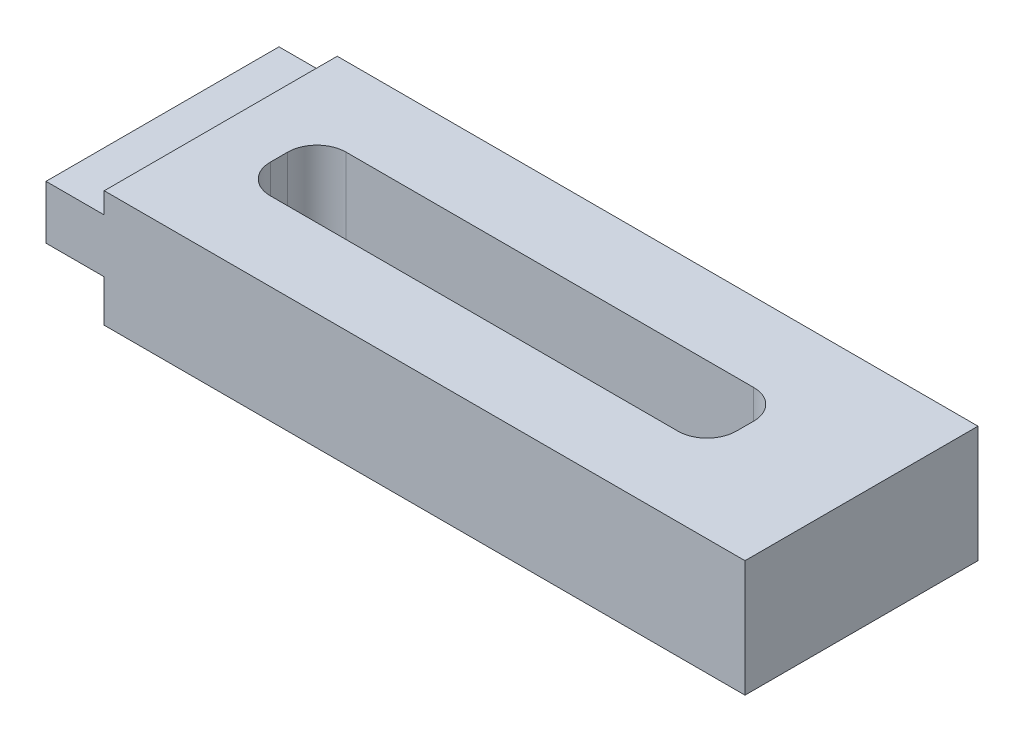
ISO-10303-21;
HEADER;
FILE_DESCRIPTION(('STEP AP214'),'2;1');
FILE_NAME('part.step','',(''),(''),'','','');
FILE_SCHEMA(('AUTOMOTIVE_DESIGN { 1 0 10303 214 1 1 1 1 }'));
ENDSEC;
DATA;
#1=APPLICATION_CONTEXT('core data for automotive mechanical design processes');
#2=APPLICATION_PROTOCOL_DEFINITION('international standard','automotive_design',2000,#1);
#3=PRODUCT_CONTEXT('',#1,'mechanical');
#4=PRODUCT('Part','Part','',(#3));
#5=PRODUCT_RELATED_PRODUCT_CATEGORY('part','',(#4));
#6=PRODUCT_DEFINITION_FORMATION('','',#4);
#7=PRODUCT_DEFINITION_CONTEXT('part definition',#1,'design');
#8=PRODUCT_DEFINITION('design','',#6,#7);
#9=PRODUCT_DEFINITION_SHAPE('','',#8);
#10=(LENGTH_UNIT() NAMED_UNIT(*) SI_UNIT(.MILLI.,.METRE.));
#11=(NAMED_UNIT(*) PLANE_ANGLE_UNIT() SI_UNIT($,.RADIAN.));
#12=(NAMED_UNIT(*) SI_UNIT($,.STERADIAN.) SOLID_ANGLE_UNIT());
#13=UNCERTAINTY_MEASURE_WITH_UNIT(LENGTH_MEASURE(1.E-05),#10,'distance_accuracy_value','');
#14=(GEOMETRIC_REPRESENTATION_CONTEXT(3) GLOBAL_UNCERTAINTY_ASSIGNED_CONTEXT((#13)) GLOBAL_UNIT_ASSIGNED_CONTEXT((#10,
#11,#12)) REPRESENTATION_CONTEXT('',''));
#15=CARTESIAN_POINT('',(0.,0.,0.));
#16=DIRECTION('',(0.,0.,1.));
#17=DIRECTION('',(1.,0.,0.));
#18=AXIS2_PLACEMENT_3D('',#15,#16,#17);
#19=CARTESIAN_POINT('',(0.,12.7,0.));
#20=DIRECTION('',(1.,0.,0.));
#21=DIRECTION('',(0.,0.,-1.));
#22=AXIS2_PLACEMENT_3D('',#19,#20,#21);
#23=PLANE('',#22);
#24=DIRECTION('',(0.,-1.,0.));
#25=VECTOR('',#24,1.);
#26=CARTESIAN_POINT('',(0.,12.7,0.));
#27=LINE('',#26,#25);
#28=CARTESIAN_POINT('',(0.,10.414,0.));
#29=VERTEX_POINT('',#28);
#30=CARTESIAN_POINT('',(0.,4.572,0.));
#31=VERTEX_POINT('',#30);
#32=EDGE_CURVE('E11',#29,#31,#27,.T.);
#33=ORIENTED_EDGE('',*,*,#32,.F.);
#34=DIRECTION('',(0.,0.,1.));
#35=VECTOR('',#34,1.);
#36=CARTESIAN_POINT('',(0.,10.414,-25.4));
#37=LINE('',#36,#35);
#38=CARTESIAN_POINT('',(0.,10.414,-25.4));
#39=VERTEX_POINT('',#38);
#40=EDGE_CURVE('E154',#39,#29,#37,.T.);
#41=ORIENTED_EDGE('',*,*,#40,.F.);
#42=DIRECTION('',(0.,-1.,0.));
#43=VECTOR('',#42,1.);
#44=CARTESIAN_POINT('',(0.,12.7,-25.4));
#45=LINE('',#44,#43);
#46=CARTESIAN_POINT('',(0.,4.572,-25.4));
#47=VERTEX_POINT('',#46);
#48=EDGE_CURVE('E167',#39,#47,#45,.T.);
#49=ORIENTED_EDGE('',*,*,#48,.T.);
#50=DIRECTION('',(0.,0.,1.));
#51=VECTOR('',#50,1.);
#52=CARTESIAN_POINT('',(0.,4.572,-25.4));
#53=LINE('',#52,#51);
#54=EDGE_CURVE('E251',#47,#31,#53,.T.);
#55=ORIENTED_EDGE('',*,*,#54,.T.);
#56=EDGE_LOOP('',(#33,#41,#49,#55));
#57=FACE_BOUND('',#56,.T.);
#58=ADVANCED_FACE('F38',(#57),#23,.F.);
#59=CARTESIAN_POINT('',(0.,12.7,0.));
#60=DIRECTION('',(0.,0.,-1.));
#61=DIRECTION('',(-1.,0.,0.));
#62=AXIS2_PLACEMENT_3D('',#59,#60,#61);
#63=PLANE('',#62);
#64=DIRECTION('',(1.,0.,0.));
#65=VECTOR('',#64,1.);
#66=CARTESIAN_POINT('',(0.,12.7,0.));
#67=LINE('',#66,#65);
#68=CARTESIAN_POINT('',(6.35,12.7,0.));
#69=VERTEX_POINT('',#68);
#70=CARTESIAN_POINT('',(76.2,12.7,0.));
#71=VERTEX_POINT('',#70);
#72=EDGE_CURVE('E203',#69,#71,#67,.T.);
#73=ORIENTED_EDGE('',*,*,#72,.F.);
#74=DIRECTION('',(0.,1.,0.));
#75=VECTOR('',#74,1.);
#76=CARTESIAN_POINT('',(6.35,12.7,0.));
#77=LINE('',#76,#75);
#78=CARTESIAN_POINT('',(6.35,10.414,0.));
#79=VERTEX_POINT('',#78);
#80=EDGE_CURVE('E52',#79,#69,#77,.T.);
#81=ORIENTED_EDGE('',*,*,#80,.F.);
#82=DIRECTION('',(1.,0.,0.));
#83=VECTOR('',#82,1.);
#84=CARTESIAN_POINT('',(0.,10.414,0.));
#85=LINE('',#84,#83);
#86=EDGE_CURVE('E293',#29,#79,#85,.T.);
#87=ORIENTED_EDGE('',*,*,#86,.F.);
#88=ORIENTED_EDGE('',*,*,#32,.T.);
#89=DIRECTION('',(-1.,0.,0.));
#90=VECTOR('',#89,1.);
#91=CARTESIAN_POINT('',(0.,4.572,0.));
#92=LINE('',#91,#90);
#93=CARTESIAN_POINT('',(6.35,4.572,0.));
#94=VERTEX_POINT('',#93);
#95=EDGE_CURVE('E279',#94,#31,#92,.T.);
#96=ORIENTED_EDGE('',*,*,#95,.F.);
#97=DIRECTION('',(0.,1.,0.));
#98=VECTOR('',#97,1.);
#99=CARTESIAN_POINT('',(6.35,4.572,0.));
#100=LINE('',#99,#98);
#101=CARTESIAN_POINT('',(6.35,0.,0.));
#102=VERTEX_POINT('',#101);
#103=EDGE_CURVE('E282',#102,#94,#100,.T.);
#104=ORIENTED_EDGE('',*,*,#103,.F.);
#105=DIRECTION('',(1.,0.,0.));
#106=VECTOR('',#105,1.);
#107=CARTESIAN_POINT('',(0.,0.,0.));
#108=LINE('',#107,#106);
#109=CARTESIAN_POINT('',(76.2,0.,0.));
#110=VERTEX_POINT('',#109);
#111=EDGE_CURVE('E201',#102,#110,#108,.T.);
#112=ORIENTED_EDGE('',*,*,#111,.T.);
#113=DIRECTION('',(0.,-1.,0.));
#114=VECTOR('',#113,1.);
#115=CARTESIAN_POINT('',(76.2,12.7,0.));
#116=LINE('',#115,#114);
#117=EDGE_CURVE('E45',#71,#110,#116,.T.);
#118=ORIENTED_EDGE('',*,*,#117,.F.);
#119=EDGE_LOOP('',(#73,#81,#87,#88,#96,#104,#112,#118));
#120=FACE_BOUND('',#119,.T.);
#121=ADVANCED_FACE('F299',(#120),#63,.F.);
#122=CARTESIAN_POINT('',(76.2,12.7,0.));
#123=DIRECTION('',(-1.,0.,0.));
#124=DIRECTION('',(0.,0.,1.));
#125=AXIS2_PLACEMENT_3D('',#122,#123,#124);
#126=PLANE('',#125);
#127=DIRECTION('',(0.,0.,-1.));
#128=VECTOR('',#127,1.);
#129=CARTESIAN_POINT('',(76.2,0.,0.));
#130=LINE('',#129,#128);
#131=CARTESIAN_POINT('',(76.2,0.,-25.4));
#132=VERTEX_POINT('',#131);
#133=EDGE_CURVE('E193',#110,#132,#130,.T.);
#134=ORIENTED_EDGE('',*,*,#133,.T.);
#135=DIRECTION('',(0.,-1.,0.));
#136=VECTOR('',#135,1.);
#137=CARTESIAN_POINT('',(76.2,12.7,-25.4));
#138=LINE('',#137,#136);
#139=CARTESIAN_POINT('',(76.2,12.7,-25.4));
#140=VERTEX_POINT('',#139);
#141=EDGE_CURVE('E174',#140,#132,#138,.T.);
#142=ORIENTED_EDGE('',*,*,#141,.F.);
#143=DIRECTION('',(0.,0.,-1.));
#144=VECTOR('',#143,1.);
#145=CARTESIAN_POINT('',(76.2,12.7,0.));
#146=LINE('',#145,#144);
#147=EDGE_CURVE('E181',#71,#140,#146,.T.);
#148=ORIENTED_EDGE('',*,*,#147,.F.);
#149=ORIENTED_EDGE('',*,*,#117,.T.);
#150=EDGE_LOOP('',(#134,#142,#148,#149));
#151=FACE_BOUND('',#150,.T.);
#152=ADVANCED_FACE('F191',(#151),#126,.F.);
#153=CARTESIAN_POINT('',(0.,12.7,-25.4));
#154=DIRECTION('',(0.,0.,1.));
#155=DIRECTION('',(1.,0.,0.));
#156=AXIS2_PLACEMENT_3D('',#153,#154,#155);
#157=PLANE('',#156);
#158=DIRECTION('',(1.,0.,0.));
#159=VECTOR('',#158,1.);
#160=CARTESIAN_POINT('',(0.,10.414,-25.4));
#161=LINE('',#160,#159);
#162=CARTESIAN_POINT('',(6.35,10.414,-25.4));
#163=VERTEX_POINT('',#162);
#164=EDGE_CURVE('E150',#39,#163,#161,.T.);
#165=ORIENTED_EDGE('',*,*,#164,.T.);
#166=DIRECTION('',(0.,1.,0.));
#167=VECTOR('',#166,1.);
#168=CARTESIAN_POINT('',(6.35,12.7,-25.4));
#169=LINE('',#168,#167);
#170=CARTESIAN_POINT('',(6.35,12.7,-25.4));
#171=VERTEX_POINT('',#170);
#172=EDGE_CURVE('E162',#163,#171,#169,.T.);
#173=ORIENTED_EDGE('',*,*,#172,.T.);
#174=DIRECTION('',(-1.,0.,0.));
#175=VECTOR('',#174,1.);
#176=CARTESIAN_POINT('',(0.,12.7,-25.4));
#177=LINE('',#176,#175);
#178=EDGE_CURVE('E175',#140,#171,#177,.T.);
#179=ORIENTED_EDGE('',*,*,#178,.F.);
#180=ORIENTED_EDGE('',*,*,#141,.T.);
#181=DIRECTION('',(-1.,0.,0.));
#182=VECTOR('',#181,1.);
#183=CARTESIAN_POINT('',(0.,0.,-25.4));
#184=LINE('',#183,#182);
#185=CARTESIAN_POINT('',(6.35,0.,-25.4));
#186=VERTEX_POINT('',#185);
#187=EDGE_CURVE('E184',#132,#186,#184,.T.);
#188=ORIENTED_EDGE('',*,*,#187,.T.);
#189=DIRECTION('',(0.,1.,0.));
#190=VECTOR('',#189,1.);
#191=CARTESIAN_POINT('',(6.35,4.572,-25.4));
#192=LINE('',#191,#190);
#193=CARTESIAN_POINT('',(6.35,4.572,-25.4));
#194=VERTEX_POINT('',#193);
#195=EDGE_CURVE('E60',#186,#194,#192,.T.);
#196=ORIENTED_EDGE('',*,*,#195,.T.);
#197=DIRECTION('',(-1.,0.,0.));
#198=VECTOR('',#197,1.);
#199=CARTESIAN_POINT('',(0.,4.572,-25.4));
#200=LINE('',#199,#198);
#201=EDGE_CURVE('E173',#194,#47,#200,.T.);
#202=ORIENTED_EDGE('',*,*,#201,.T.);
#203=ORIENTED_EDGE('',*,*,#48,.F.);
#204=EDGE_LOOP('',(#165,#173,#179,#180,#188,#196,#202,#203));
#205=FACE_BOUND('',#204,.T.);
#206=ADVANCED_FACE('F171',(#205),#157,.F.);
#207=CARTESIAN_POINT('',(0.,12.7,-25.4));
#208=DIRECTION('',(0.,-1.,0.));
#209=DIRECTION('',(0.,0.,-1.));
#210=AXIS2_PLACEMENT_3D('',#207,#208,#209);
#211=PLANE('',#210);
#212=DIRECTION('',(0.,0.,-1.));
#213=VECTOR('',#212,1.);
#214=CARTESIAN_POINT('',(63.5,12.7,-11.7475));
#215=LINE('',#214,#213);
#216=CARTESIAN_POINT('',(63.5,12.7,-11.7475));
#217=VERTEX_POINT('',#216);
#218=CARTESIAN_POINT('',(63.5,12.7,-13.6525));
#219=VERTEX_POINT('',#218);
#220=EDGE_CURVE('E246',#217,#219,#215,.T.);
#221=ORIENTED_EDGE('',*,*,#220,.F.);
#222=CARTESIAN_POINT('',(60.325,12.7,-11.7475));
#223=DIRECTION('',(0.,1.,0.));
#224=DIRECTION('',(0.,0.,1.));
#225=AXIS2_PLACEMENT_3D('',#222,#223,#224);
#226=CIRCLE('',#225,3.175);
#227=CARTESIAN_POINT('',(60.325,12.7,-8.5725));
#228=VERTEX_POINT('',#227);
#229=EDGE_CURVE('E249',#228,#217,#226,.T.);
#230=ORIENTED_EDGE('',*,*,#229,.F.);
#231=DIRECTION('',(1.,0.,0.));
#232=VECTOR('',#231,1.);
#233=CARTESIAN_POINT('',(15.875,12.7,-8.5725));
#234=LINE('',#233,#232);
#235=CARTESIAN_POINT('',(15.875,12.7,-8.5725));
#236=VERTEX_POINT('',#235);
#237=EDGE_CURVE('E226',#236,#228,#234,.T.);
#238=ORIENTED_EDGE('',*,*,#237,.F.);
#239=CARTESIAN_POINT('',(15.875,12.7,-11.7475));
#240=DIRECTION('',(0.,1.,0.));
#241=DIRECTION('',(0.,0.,-1.));
#242=AXIS2_PLACEMENT_3D('',#239,#240,#241);
#243=CIRCLE('',#242,3.175);
#244=CARTESIAN_POINT('',(12.7,12.7,-11.7475));
#245=VERTEX_POINT('',#244);
#246=EDGE_CURVE('E230',#245,#236,#243,.T.);
#247=ORIENTED_EDGE('',*,*,#246,.F.);
#248=DIRECTION('',(0.,0.,1.));
#249=VECTOR('',#248,1.);
#250=CARTESIAN_POINT('',(12.7,12.7,-11.7475));
#251=LINE('',#250,#249);
#252=CARTESIAN_POINT('',(12.7,12.7,-13.6525));
#253=VERTEX_POINT('',#252);
#254=EDGE_CURVE('E233',#253,#245,#251,.T.);
#255=ORIENTED_EDGE('',*,*,#254,.F.);
#256=CARTESIAN_POINT('',(15.875,12.7,-13.6525));
#257=DIRECTION('',(0.,1.,0.));
#258=DIRECTION('',(0.,0.,1.));
#259=AXIS2_PLACEMENT_3D('',#256,#257,#258);
#260=CIRCLE('',#259,3.175);
#261=CARTESIAN_POINT('',(15.875,12.7,-16.8275));
#262=VERTEX_POINT('',#261);
#263=EDGE_CURVE('E236',#262,#253,#260,.T.);
#264=ORIENTED_EDGE('',*,*,#263,.F.);
#265=DIRECTION('',(-1.,0.,0.));
#266=VECTOR('',#265,1.);
#267=CARTESIAN_POINT('',(15.875,12.7,-16.8275));
#268=LINE('',#267,#266);
#269=CARTESIAN_POINT('',(60.325,12.7,-16.8275));
#270=VERTEX_POINT('',#269);
#271=EDGE_CURVE('E239',#270,#262,#268,.T.);
#272=ORIENTED_EDGE('',*,*,#271,.F.);
#273=CARTESIAN_POINT('',(60.325,12.7,-13.6525));
#274=DIRECTION('',(0.,1.,0.));
#275=DIRECTION('',(0.,0.,-1.));
#276=AXIS2_PLACEMENT_3D('',#273,#274,#275);
#277=CIRCLE('',#276,3.175);
#278=EDGE_CURVE('E243',#219,#270,#277,.T.);
#279=ORIENTED_EDGE('',*,*,#278,.F.);
#280=EDGE_LOOP('',(#221,#230,#238,#247,#255,#264,#272,#279));
#281=FACE_BOUND('',#280,.T.);
#282=ORIENTED_EDGE('',*,*,#178,.T.);
#283=DIRECTION('',(0.,0.,1.));
#284=VECTOR('',#283,1.);
#285=CARTESIAN_POINT('',(6.35,12.7,-25.4));
#286=LINE('',#285,#284);
#287=EDGE_CURVE('E285',#171,#69,#286,.T.);
#288=ORIENTED_EDGE('',*,*,#287,.T.);
#289=ORIENTED_EDGE('',*,*,#72,.T.);
#290=ORIENTED_EDGE('',*,*,#147,.T.);
#291=EDGE_LOOP('',(#282,#288,#289,#290));
#292=FACE_BOUND('',#291,.T.);
#293=ADVANCED_FACE('F298',(#281,#292),#211,.F.);
#294=CARTESIAN_POINT('',(0.,0.,-25.4));
#295=DIRECTION('',(0.,-1.,0.));
#296=DIRECTION('',(0.,0.,-1.));
#297=AXIS2_PLACEMENT_3D('',#294,#295,#296);
#298=PLANE('',#297);
#299=DIRECTION('',(0.,0.,1.));
#300=VECTOR('',#299,1.);
#301=CARTESIAN_POINT('',(6.35,0.,-25.4));
#302=LINE('',#301,#300);
#303=EDGE_CURVE('E274',#186,#102,#302,.T.);
#304=ORIENTED_EDGE('',*,*,#303,.F.);
#305=ORIENTED_EDGE('',*,*,#187,.F.);
#306=ORIENTED_EDGE('',*,*,#133,.F.);
#307=ORIENTED_EDGE('',*,*,#111,.F.);
#308=EDGE_LOOP('',(#304,#305,#306,#307));
#309=FACE_BOUND('',#308,.T.);
#310=CARTESIAN_POINT('',(60.325,0.,-11.7475));
#311=DIRECTION('',(0.,1.,0.));
#312=DIRECTION('',(0.,0.,1.));
#313=AXIS2_PLACEMENT_3D('',#310,#311,#312);
#314=CIRCLE('',#313,3.175);
#315=CARTESIAN_POINT('',(60.325,0.,-8.5725));
#316=VERTEX_POINT('',#315);
#317=CARTESIAN_POINT('',(63.5,0.,-11.7475));
#318=VERTEX_POINT('',#317);
#319=EDGE_CURVE('E229',#316,#318,#314,.T.);
#320=ORIENTED_EDGE('',*,*,#319,.T.);
#321=DIRECTION('',(0.,0.,-1.));
#322=VECTOR('',#321,1.);
#323=CARTESIAN_POINT('',(63.5,0.,-11.7475));
#324=LINE('',#323,#322);
#325=CARTESIAN_POINT('',(63.5,0.,-13.6525));
#326=VERTEX_POINT('',#325);
#327=EDGE_CURVE('E269',#318,#326,#324,.T.);
#328=ORIENTED_EDGE('',*,*,#327,.T.);
#329=CARTESIAN_POINT('',(60.325,0.,-13.6525));
#330=DIRECTION('',(0.,1.,0.));
#331=DIRECTION('',(0.,0.,-1.));
#332=AXIS2_PLACEMENT_3D('',#329,#330,#331);
#333=CIRCLE('',#332,3.175);
#334=CARTESIAN_POINT('',(60.325,0.,-16.8275));
#335=VERTEX_POINT('',#334);
#336=EDGE_CURVE('E266',#326,#335,#333,.T.);
#337=ORIENTED_EDGE('',*,*,#336,.T.);
#338=DIRECTION('',(-1.,0.,0.));
#339=VECTOR('',#338,1.);
#340=CARTESIAN_POINT('',(15.875,0.,-16.8275));
#341=LINE('',#340,#339);
#342=CARTESIAN_POINT('',(15.875,0.,-16.8275));
#343=VERTEX_POINT('',#342);
#344=EDGE_CURVE('E263',#335,#343,#341,.T.);
#345=ORIENTED_EDGE('',*,*,#344,.T.);
#346=CARTESIAN_POINT('',(15.875,0.,-13.6525));
#347=DIRECTION('',(0.,1.,0.));
#348=DIRECTION('',(0.,0.,1.));
#349=AXIS2_PLACEMENT_3D('',#346,#347,#348);
#350=CIRCLE('',#349,3.175);
#351=CARTESIAN_POINT('',(12.7,0.,-13.6525));
#352=VERTEX_POINT('',#351);
#353=EDGE_CURVE('E260',#343,#352,#350,.T.);
#354=ORIENTED_EDGE('',*,*,#353,.T.);
#355=DIRECTION('',(0.,0.,1.));
#356=VECTOR('',#355,1.);
#357=CARTESIAN_POINT('',(12.7,0.,-11.7475));
#358=LINE('',#357,#356);
#359=CARTESIAN_POINT('',(12.7,0.,-11.7475));
#360=VERTEX_POINT('',#359);
#361=EDGE_CURVE('E257',#352,#360,#358,.T.);
#362=ORIENTED_EDGE('',*,*,#361,.T.);
#363=CARTESIAN_POINT('',(15.875,0.,-11.7475));
#364=DIRECTION('',(0.,1.,0.));
#365=DIRECTION('',(0.,0.,-1.));
#366=AXIS2_PLACEMENT_3D('',#363,#364,#365);
#367=CIRCLE('',#366,3.175);
#368=CARTESIAN_POINT('',(15.875,0.,-8.5725));
#369=VERTEX_POINT('',#368);
#370=EDGE_CURVE('E254',#360,#369,#367,.T.);
#371=ORIENTED_EDGE('',*,*,#370,.T.);
#372=DIRECTION('',(1.,0.,0.));
#373=VECTOR('',#372,1.);
#374=CARTESIAN_POINT('',(15.875,0.,-8.5725));
#375=LINE('',#374,#373);
#376=EDGE_CURVE('E213',#369,#316,#375,.T.);
#377=ORIENTED_EDGE('',*,*,#376,.T.);
#378=EDGE_LOOP('',(#320,#328,#337,#345,#354,#362,#371,#377));
#379=FACE_BOUND('',#378,.T.);
#380=ADVANCED_FACE('F199',(#309,#379),#298,.T.);
#381=CARTESIAN_POINT('',(60.325,0.,-11.7475));
#382=DIRECTION('',(0.,1.,0.));
#383=DIRECTION('',(0.,0.,1.));
#384=AXIS2_PLACEMENT_3D('',#381,#382,#383);
#385=CYLINDRICAL_SURFACE('',#384,3.175);
#386=ORIENTED_EDGE('',*,*,#229,.T.);
#387=DIRECTION('',(0.,1.,0.));
#388=VECTOR('',#387,1.);
#389=CARTESIAN_POINT('',(63.5,0.,-11.7475));
#390=LINE('',#389,#388);
#391=EDGE_CURVE('E209',#318,#217,#390,.T.);
#392=ORIENTED_EDGE('',*,*,#391,.F.);
#393=ORIENTED_EDGE('',*,*,#319,.F.);
#394=DIRECTION('',(0.,1.,0.));
#395=VECTOR('',#394,1.);
#396=CARTESIAN_POINT('',(60.325,0.,-8.5725));
#397=LINE('',#396,#395);
#398=EDGE_CURVE('E204',#316,#228,#397,.T.);
#399=ORIENTED_EDGE('',*,*,#398,.T.);
#400=EDGE_LOOP('',(#386,#392,#393,#399));
#401=FACE_BOUND('',#400,.T.);
#402=ADVANCED_FACE('F329',(#401),#385,.F.);
#403=CARTESIAN_POINT('',(15.875,0.,-8.5725));
#404=DIRECTION('',(0.,0.,1.));
#405=DIRECTION('',(1.,0.,0.));
#406=AXIS2_PLACEMENT_3D('',#403,#404,#405);
#407=PLANE('',#406);
#408=ORIENTED_EDGE('',*,*,#237,.T.);
#409=ORIENTED_EDGE('',*,*,#398,.F.);
#410=ORIENTED_EDGE('',*,*,#376,.F.);
#411=DIRECTION('',(0.,1.,0.));
#412=VECTOR('',#411,1.);
#413=CARTESIAN_POINT('',(15.875,0.,-8.5725));
#414=LINE('',#413,#412);
#415=EDGE_CURVE('E223',#369,#236,#414,.T.);
#416=ORIENTED_EDGE('',*,*,#415,.T.);
#417=EDGE_LOOP('',(#408,#409,#410,#416));
#418=FACE_BOUND('',#417,.T.);
#419=ADVANCED_FACE('F335',(#418),#407,.F.);
#420=CARTESIAN_POINT('',(15.875,0.,-11.7475));
#421=DIRECTION('',(0.,1.,0.));
#422=DIRECTION('',(0.,0.,1.));
#423=AXIS2_PLACEMENT_3D('',#420,#421,#422);
#424=CYLINDRICAL_SURFACE('',#423,3.175);
#425=ORIENTED_EDGE('',*,*,#246,.T.);
#426=ORIENTED_EDGE('',*,*,#415,.F.);
#427=ORIENTED_EDGE('',*,*,#370,.F.);
#428=DIRECTION('',(0.,1.,0.));
#429=VECTOR('',#428,1.);
#430=CARTESIAN_POINT('',(12.7,0.,-11.7475));
#431=LINE('',#430,#429);
#432=EDGE_CURVE('E221',#360,#245,#431,.T.);
#433=ORIENTED_EDGE('',*,*,#432,.T.);
#434=EDGE_LOOP('',(#425,#426,#427,#433));
#435=FACE_BOUND('',#434,.T.);
#436=ADVANCED_FACE('F355',(#435),#424,.F.);
#437=CARTESIAN_POINT('',(12.7,0.,-11.7475));
#438=DIRECTION('',(-1.,0.,0.));
#439=DIRECTION('',(0.,0.,1.));
#440=AXIS2_PLACEMENT_3D('',#437,#438,#439);
#441=PLANE('',#440);
#442=ORIENTED_EDGE('',*,*,#254,.T.);
#443=ORIENTED_EDGE('',*,*,#432,.F.);
#444=ORIENTED_EDGE('',*,*,#361,.F.);
#445=DIRECTION('',(0.,1.,0.));
#446=VECTOR('',#445,1.);
#447=CARTESIAN_POINT('',(12.7,0.,-13.6525));
#448=LINE('',#447,#446);
#449=EDGE_CURVE('E219',#352,#253,#448,.T.);
#450=ORIENTED_EDGE('',*,*,#449,.T.);
#451=EDGE_LOOP('',(#442,#443,#444,#450));
#452=FACE_BOUND('',#451,.T.);
#453=ADVANCED_FACE('F351',(#452),#441,.F.);
#454=CARTESIAN_POINT('',(15.875,0.,-13.6525));
#455=DIRECTION('',(0.,1.,0.));
#456=DIRECTION('',(0.,0.,1.));
#457=AXIS2_PLACEMENT_3D('',#454,#455,#456);
#458=CYLINDRICAL_SURFACE('',#457,3.175);
#459=ORIENTED_EDGE('',*,*,#263,.T.);
#460=ORIENTED_EDGE('',*,*,#449,.F.);
#461=ORIENTED_EDGE('',*,*,#353,.F.);
#462=DIRECTION('',(0.,1.,0.));
#463=VECTOR('',#462,1.);
#464=CARTESIAN_POINT('',(15.875,0.,-16.8275));
#465=LINE('',#464,#463);
#466=EDGE_CURVE('E217',#343,#262,#465,.T.);
#467=ORIENTED_EDGE('',*,*,#466,.T.);
#468=EDGE_LOOP('',(#459,#460,#461,#467));
#469=FACE_BOUND('',#468,.T.);
#470=ADVANCED_FACE('F347',(#469),#458,.F.);
#471=CARTESIAN_POINT('',(15.875,0.,-16.8275));
#472=DIRECTION('',(0.,0.,-1.));
#473=DIRECTION('',(-1.,0.,0.));
#474=AXIS2_PLACEMENT_3D('',#471,#472,#473);
#475=PLANE('',#474);
#476=ORIENTED_EDGE('',*,*,#271,.T.);
#477=ORIENTED_EDGE('',*,*,#466,.F.);
#478=ORIENTED_EDGE('',*,*,#344,.F.);
#479=DIRECTION('',(0.,1.,0.));
#480=VECTOR('',#479,1.);
#481=CARTESIAN_POINT('',(60.325,0.,-16.8275));
#482=LINE('',#481,#480);
#483=EDGE_CURVE('E215',#335,#270,#482,.T.);
#484=ORIENTED_EDGE('',*,*,#483,.T.);
#485=EDGE_LOOP('',(#476,#477,#478,#484));
#486=FACE_BOUND('',#485,.T.);
#487=ADVANCED_FACE('F343',(#486),#475,.F.);
#488=CARTESIAN_POINT('',(60.325,0.,-13.6525));
#489=DIRECTION('',(0.,1.,0.));
#490=DIRECTION('',(0.,0.,1.));
#491=AXIS2_PLACEMENT_3D('',#488,#489,#490);
#492=CYLINDRICAL_SURFACE('',#491,3.175);
#493=ORIENTED_EDGE('',*,*,#278,.T.);
#494=ORIENTED_EDGE('',*,*,#483,.F.);
#495=ORIENTED_EDGE('',*,*,#336,.F.);
#496=DIRECTION('',(0.,1.,0.));
#497=VECTOR('',#496,1.);
#498=CARTESIAN_POINT('',(63.5,0.,-13.6525));
#499=LINE('',#498,#497);
#500=EDGE_CURVE('E212',#326,#219,#499,.T.);
#501=ORIENTED_EDGE('',*,*,#500,.T.);
#502=EDGE_LOOP('',(#493,#494,#495,#501));
#503=FACE_BOUND('',#502,.T.);
#504=ADVANCED_FACE('F339',(#503),#492,.F.);
#505=CARTESIAN_POINT('',(63.5,0.,-11.7475));
#506=DIRECTION('',(1.,0.,0.));
#507=DIRECTION('',(0.,0.,-1.));
#508=AXIS2_PLACEMENT_3D('',#505,#506,#507);
#509=PLANE('',#508);
#510=ORIENTED_EDGE('',*,*,#220,.T.);
#511=ORIENTED_EDGE('',*,*,#500,.F.);
#512=ORIENTED_EDGE('',*,*,#327,.F.);
#513=ORIENTED_EDGE('',*,*,#391,.T.);
#514=EDGE_LOOP('',(#510,#511,#512,#513));
#515=FACE_BOUND('',#514,.T.);
#516=ADVANCED_FACE('F313',(#515),#509,.F.);
#517=CARTESIAN_POINT('',(0.,4.572,-25.4));
#518=DIRECTION('',(0.,1.,0.));
#519=DIRECTION('',(0.,0.,1.));
#520=AXIS2_PLACEMENT_3D('',#517,#518,#519);
#521=PLANE('',#520);
#522=ORIENTED_EDGE('',*,*,#95,.T.);
#523=ORIENTED_EDGE('',*,*,#54,.F.);
#524=ORIENTED_EDGE('',*,*,#201,.F.);
#525=DIRECTION('',(0.,0.,1.));
#526=VECTOR('',#525,1.);
#527=CARTESIAN_POINT('',(6.35,4.572,-25.4));
#528=LINE('',#527,#526);
#529=EDGE_CURVE('E276',#194,#94,#528,.T.);
#530=ORIENTED_EDGE('',*,*,#529,.T.);
#531=EDGE_LOOP('',(#522,#523,#524,#530));
#532=FACE_BOUND('',#531,.T.);
#533=ADVANCED_FACE('F303',(#532),#521,.F.);
#534=CARTESIAN_POINT('',(6.35,4.572,-25.4));
#535=DIRECTION('',(1.,0.,0.));
#536=DIRECTION('',(0.,1.,0.));
#537=AXIS2_PLACEMENT_3D('',#534,#535,#536);
#538=PLANE('',#537);
#539=ORIENTED_EDGE('',*,*,#103,.T.);
#540=ORIENTED_EDGE('',*,*,#529,.F.);
#541=ORIENTED_EDGE('',*,*,#195,.F.);
#542=ORIENTED_EDGE('',*,*,#303,.T.);
#543=EDGE_LOOP('',(#539,#540,#541,#542));
#544=FACE_BOUND('',#543,.T.);
#545=ADVANCED_FACE('F304',(#544),#538,.F.);
#546=CARTESIAN_POINT('',(6.35,12.7,-25.4));
#547=DIRECTION('',(1.,0.,0.));
#548=DIRECTION('',(0.,1.,0.));
#549=AXIS2_PLACEMENT_3D('',#546,#547,#548);
#550=PLANE('',#549);
#551=ORIENTED_EDGE('',*,*,#80,.T.);
#552=ORIENTED_EDGE('',*,*,#287,.F.);
#553=ORIENTED_EDGE('',*,*,#172,.F.);
#554=DIRECTION('',(0.,0.,1.));
#555=VECTOR('',#554,1.);
#556=CARTESIAN_POINT('',(6.35,10.414,-25.4));
#557=LINE('',#556,#555);
#558=EDGE_CURVE('E156',#163,#79,#557,.T.);
#559=ORIENTED_EDGE('',*,*,#558,.T.);
#560=EDGE_LOOP('',(#551,#552,#553,#559));
#561=FACE_BOUND('',#560,.T.);
#562=ADVANCED_FACE('F306',(#561),#550,.F.);
#563=CARTESIAN_POINT('',(0.,10.414,-25.4));
#564=DIRECTION('',(0.,-1.,0.));
#565=DIRECTION('',(0.,0.,-1.));
#566=AXIS2_PLACEMENT_3D('',#563,#564,#565);
#567=PLANE('',#566);
#568=ORIENTED_EDGE('',*,*,#86,.T.);
#569=ORIENTED_EDGE('',*,*,#558,.F.);
#570=ORIENTED_EDGE('',*,*,#164,.F.);
#571=ORIENTED_EDGE('',*,*,#40,.T.);
#572=EDGE_LOOP('',(#568,#569,#570,#571));
#573=FACE_BOUND('',#572,.T.);
#574=ADVANCED_FACE('F153',(#573),#567,.F.);
#575=CLOSED_SHELL('',(#58,#121,#152,#206,#293,#380,#402,#419,#436,#453,#470,#487,#504,#516,#533,
#545,#562,#574));
#576=MANIFOLD_SOLID_BREP('B2',#575);
#577=ADVANCED_BREP_SHAPE_REPRESENTATION('',(#18,#576),#14);
#578=SHAPE_DEFINITION_REPRESENTATION(#9,#577);
ENDSEC;
END-ISO-10303-21;
